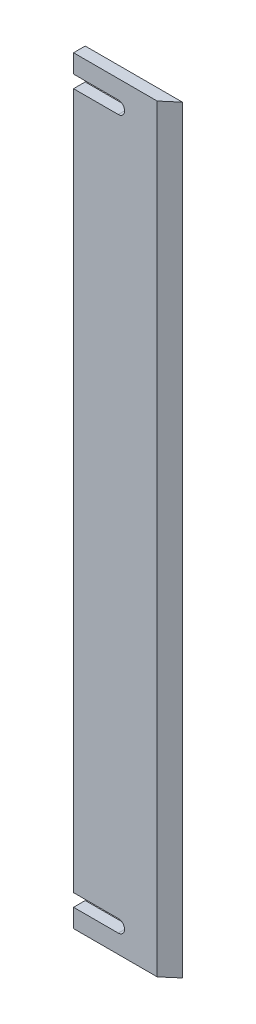
ISO-10303-21;
HEADER;
FILE_DESCRIPTION(('STEP AP214'),'2;1');
FILE_NAME('part.step','',(''),(''),'','','');
FILE_SCHEMA(('AUTOMOTIVE_DESIGN { 1 0 10303 214 1 1 1 1 }'));
ENDSEC;
DATA;
#1=APPLICATION_CONTEXT('core data for automotive mechanical design processes');
#2=APPLICATION_PROTOCOL_DEFINITION('international standard','automotive_design',2000,#1);
#3=PRODUCT_CONTEXT('',#1,'mechanical');
#4=PRODUCT('Part','Part','',(#3));
#5=PRODUCT_RELATED_PRODUCT_CATEGORY('part','',(#4));
#6=PRODUCT_DEFINITION_FORMATION('','',#4);
#7=PRODUCT_DEFINITION_CONTEXT('part definition',#1,'design');
#8=PRODUCT_DEFINITION('design','',#6,#7);
#9=PRODUCT_DEFINITION_SHAPE('','',#8);
#10=(LENGTH_UNIT() NAMED_UNIT(*) SI_UNIT(.MILLI.,.METRE.));
#11=(NAMED_UNIT(*) PLANE_ANGLE_UNIT() SI_UNIT($,.RADIAN.));
#12=(NAMED_UNIT(*) SI_UNIT($,.STERADIAN.) SOLID_ANGLE_UNIT());
#13=UNCERTAINTY_MEASURE_WITH_UNIT(LENGTH_MEASURE(1.E-05),#10,'distance_accuracy_value','');
#14=(GEOMETRIC_REPRESENTATION_CONTEXT(3) GLOBAL_UNCERTAINTY_ASSIGNED_CONTEXT((#13)) GLOBAL_UNIT_ASSIGNED_CONTEXT((#10,
#11,#12)) REPRESENTATION_CONTEXT('',''));
#15=CARTESIAN_POINT('',(0.,0.,0.));
#16=DIRECTION('',(0.,0.,1.));
#17=DIRECTION('',(1.,0.,0.));
#18=AXIS2_PLACEMENT_3D('',#15,#16,#17);
#19=CARTESIAN_POINT('',(-12.8506493506493,195.,-3.));
#20=DIRECTION('',(1.,0.,0.));
#21=DIRECTION('',(0.,0.,-1.));
#22=AXIS2_PLACEMENT_3D('',#19,#20,#21);
#23=PLANE('',#22);
#24=DIRECTION('',(0.,-1.,0.));
#25=VECTOR('',#24,1.);
#26=CARTESIAN_POINT('',(-12.8506493506493,195.,0.));
#27=LINE('',#26,#25);
#28=CARTESIAN_POINT('',(-12.8506493506494,4.75,0.));
#29=VERTEX_POINT('',#28);
#30=CARTESIAN_POINT('',(-12.8506493506493,0.,0.));
#31=VERTEX_POINT('',#30);
#32=EDGE_CURVE('E197',#29,#31,#27,.T.);
#33=ORIENTED_EDGE('',*,*,#32,.F.);
#34=DIRECTION('',(0.,0.,1.));
#35=VECTOR('',#34,1.);
#36=CARTESIAN_POINT('',(-12.8506493506494,4.75,-10.));
#37=LINE('',#36,#35);
#38=CARTESIAN_POINT('',(-12.8506493506494,4.75,-3.));
#39=VERTEX_POINT('',#38);
#40=EDGE_CURVE('E151',#39,#29,#37,.T.);
#41=ORIENTED_EDGE('',*,*,#40,.F.);
#42=DIRECTION('',(0.,-1.,0.));
#43=VECTOR('',#42,1.);
#44=CARTESIAN_POINT('',(-12.8506493506493,195.,-3.));
#45=LINE('',#44,#43);
#46=CARTESIAN_POINT('',(-12.8506493506493,0.,-3.));
#47=VERTEX_POINT('',#46);
#48=EDGE_CURVE('E178',#39,#47,#45,.T.);
#49=ORIENTED_EDGE('',*,*,#48,.T.);
#50=DIRECTION('',(0.,0.,1.));
#51=VECTOR('',#50,1.);
#52=CARTESIAN_POINT('',(-12.8506493506493,0.,-3.));
#53=LINE('',#52,#51);
#54=EDGE_CURVE('E150',#47,#31,#53,.T.);
#55=ORIENTED_EDGE('',*,*,#54,.T.);
#56=EDGE_LOOP('',(#33,#41,#49,#55));
#57=FACE_BOUND('',#56,.T.);
#58=ADVANCED_FACE('F34',(#57),#23,.F.);
#59=CARTESIAN_POINT('',(-12.8506493506493,195.,-3.));
#60=VERTEX_POINT('',#59);
#61=CARTESIAN_POINT('',(-12.8506493506494,190.25,-3.));
#62=VERTEX_POINT('',#61);
#63=EDGE_CURVE('E187',#60,#62,#45,.T.);
#64=ORIENTED_EDGE('',*,*,#63,.T.);
#65=DIRECTION('',(0.,0.,1.));
#66=VECTOR('',#65,1.);
#67=CARTESIAN_POINT('',(-12.8506493506494,190.25,-10.));
#68=LINE('',#67,#66);
#69=CARTESIAN_POINT('',(-12.8506493506494,190.25,0.));
#70=VERTEX_POINT('',#69);
#71=EDGE_CURVE('E139',#62,#70,#68,.T.);
#72=ORIENTED_EDGE('',*,*,#71,.T.);
#73=CARTESIAN_POINT('',(-12.8506493506493,195.,0.));
#74=VERTEX_POINT('',#73);
#75=EDGE_CURVE('E198',#74,#70,#27,.T.);
#76=ORIENTED_EDGE('',*,*,#75,.F.);
#77=DIRECTION('',(0.,0.,1.));
#78=VECTOR('',#77,1.);
#79=CARTESIAN_POINT('',(-12.8506493506493,195.,-3.));
#80=LINE('',#79,#78);
#81=EDGE_CURVE('E168',#60,#74,#80,.T.);
#82=ORIENTED_EDGE('',*,*,#81,.F.);
#83=EDGE_LOOP('',(#64,#72,#76,#82));
#84=FACE_BOUND('',#83,.T.);
#85=ADVANCED_FACE('F240',(#84),#23,.F.);
#86=CARTESIAN_POINT('',(-12.8506493506494,187.,-3.));
#87=VERTEX_POINT('',#86);
#88=CARTESIAN_POINT('',(-12.8506493506493,8.00000000000001,-3.));
#89=VERTEX_POINT('',#88);
#90=EDGE_CURVE('E191',#87,#89,#45,.T.);
#91=ORIENTED_EDGE('',*,*,#90,.T.);
#92=DIRECTION('',(0.,0.,1.));
#93=VECTOR('',#92,1.);
#94=CARTESIAN_POINT('',(-12.8506493506494,8.,-10.));
#95=LINE('',#94,#93);
#96=CARTESIAN_POINT('',(-12.8506493506494,8.,0.));
#97=VERTEX_POINT('',#96);
#98=EDGE_CURVE('E57',#89,#97,#95,.T.);
#99=ORIENTED_EDGE('',*,*,#98,.T.);
#100=CARTESIAN_POINT('',(-12.8506493506494,187.,0.));
#101=VERTEX_POINT('',#100);
#102=EDGE_CURVE('E145',#101,#97,#27,.T.);
#103=ORIENTED_EDGE('',*,*,#102,.F.);
#104=DIRECTION('',(0.,0.,1.));
#105=VECTOR('',#104,1.);
#106=CARTESIAN_POINT('',(-12.8506493506494,187.,-10.));
#107=LINE('',#106,#105);
#108=EDGE_CURVE('E161',#87,#101,#107,.T.);
#109=ORIENTED_EDGE('',*,*,#108,.F.);
#110=EDGE_LOOP('',(#91,#99,#103,#109));
#111=FACE_BOUND('',#110,.T.);
#112=ADVANCED_FACE('F36',(#111),#23,.F.);
#113=CARTESIAN_POINT('',(-12.8506493506493,195.,0.));
#114=DIRECTION('',(0.,0.,-1.));
#115=DIRECTION('',(-1.,0.,0.));
#116=AXIS2_PLACEMENT_3D('',#113,#114,#115);
#117=PLANE('',#116);
#118=CARTESIAN_POINT('',(-1.35064935064935,6.375,0.));
#119=DIRECTION('',(0.,0.,1.));
#120=DIRECTION('',(1.,0.,0.));
#121=AXIS2_PLACEMENT_3D('',#118,#119,#120);
#122=CIRCLE('',#121,1.625);
#123=CARTESIAN_POINT('',(-1.35064935064935,4.75,0.));
#124=VERTEX_POINT('',#123);
#125=CARTESIAN_POINT('',(-1.35064935064935,8.,0.));
#126=VERTEX_POINT('',#125);
#127=EDGE_CURVE('E132',#124,#126,#122,.T.);
#128=ORIENTED_EDGE('',*,*,#127,.F.);
#129=DIRECTION('',(1.,0.,0.));
#130=VECTOR('',#129,1.);
#131=CARTESIAN_POINT('',(-1.35064935064935,4.75,0.));
#132=LINE('',#131,#130);
#133=EDGE_CURVE('E129',#29,#124,#132,.T.);
#134=ORIENTED_EDGE('',*,*,#133,.F.);
#135=ORIENTED_EDGE('',*,*,#32,.T.);
#136=DIRECTION('',(1.,0.,0.));
#137=VECTOR('',#136,1.);
#138=CARTESIAN_POINT('',(-12.8506493506493,0.,0.));
#139=LINE('',#138,#137);
#140=CARTESIAN_POINT('',(8.64935064935065,0.,0.));
#141=VERTEX_POINT('',#140);
#142=EDGE_CURVE('E181',#31,#141,#139,.T.);
#143=ORIENTED_EDGE('',*,*,#142,.T.);
#144=DIRECTION('',(0.,-1.,0.));
#145=VECTOR('',#144,1.);
#146=CARTESIAN_POINT('',(8.64935064935065,195.,0.));
#147=LINE('',#146,#145);
#148=CARTESIAN_POINT('',(8.64935064935065,195.,0.));
#149=VERTEX_POINT('',#148);
#150=EDGE_CURVE('E194',#149,#141,#147,.T.);
#151=ORIENTED_EDGE('',*,*,#150,.F.);
#152=DIRECTION('',(1.,0.,0.));
#153=VECTOR('',#152,1.);
#154=CARTESIAN_POINT('',(-12.8506493506493,195.,0.));
#155=LINE('',#154,#153);
#156=EDGE_CURVE('E171',#74,#149,#155,.T.);
#157=ORIENTED_EDGE('',*,*,#156,.F.);
#158=ORIENTED_EDGE('',*,*,#75,.T.);
#159=DIRECTION('',(-1.,0.,0.));
#160=VECTOR('',#159,1.);
#161=CARTESIAN_POINT('',(-1.35064935064935,190.25,0.));
#162=LINE('',#161,#160);
#163=CARTESIAN_POINT('',(-1.35064935064935,190.25,0.));
#164=VERTEX_POINT('',#163);
#165=EDGE_CURVE('E159',#164,#70,#162,.T.);
#166=ORIENTED_EDGE('',*,*,#165,.F.);
#167=CARTESIAN_POINT('',(-1.35064935064935,188.625,0.));
#168=DIRECTION('',(0.,0.,1.));
#169=DIRECTION('',(-1.,0.,0.));
#170=AXIS2_PLACEMENT_3D('',#167,#168,#169);
#171=CIRCLE('',#170,1.625);
#172=CARTESIAN_POINT('',(-1.35064935064935,187.,0.));
#173=VERTEX_POINT('',#172);
#174=EDGE_CURVE('E156',#173,#164,#171,.T.);
#175=ORIENTED_EDGE('',*,*,#174,.F.);
#176=DIRECTION('',(1.,0.,0.));
#177=VECTOR('',#176,1.);
#178=CARTESIAN_POINT('',(-12.8506493506494,187.,0.));
#179=LINE('',#178,#177);
#180=EDGE_CURVE('E154',#101,#173,#179,.T.);
#181=ORIENTED_EDGE('',*,*,#180,.F.);
#182=ORIENTED_EDGE('',*,*,#102,.T.);
#183=DIRECTION('',(-1.,0.,0.));
#184=VECTOR('',#183,1.);
#185=CARTESIAN_POINT('',(-12.8506493506494,8.,0.));
#186=LINE('',#185,#184);
#187=EDGE_CURVE('E125',#126,#97,#186,.T.);
#188=ORIENTED_EDGE('',*,*,#187,.F.);
#189=EDGE_LOOP('',(#128,#134,#135,#143,#151,#157,#158,#166,#175,#181,#182,#188));
#190=FACE_BOUND('',#189,.T.);
#191=ADVANCED_FACE('F142',(#190),#117,.F.);
#192=CARTESIAN_POINT('',(8.64935064935065,195.,0.));
#193=DIRECTION('',(-0.650791373455968,0.,-0.759256602365296));
#194=DIRECTION('',(-0.759256602365297,0.,0.650791373455969));
#195=AXIS2_PLACEMENT_3D('',#192,#193,#194);
#196=PLANE('',#195);
#197=DIRECTION('',(0.759256602365297,0.,-0.650791373455969));
#198=VECTOR('',#197,1.);
#199=CARTESIAN_POINT('',(8.64935064935065,0.,0.));
#200=LINE('',#199,#198);
#201=CARTESIAN_POINT('',(12.1493506493507,0.,-3.));
#202=VERTEX_POINT('',#201);
#203=EDGE_CURVE('E183',#141,#202,#200,.T.);
#204=ORIENTED_EDGE('',*,*,#203,.T.);
#205=DIRECTION('',(0.,-1.,0.));
#206=VECTOR('',#205,1.);
#207=CARTESIAN_POINT('',(12.1493506493507,195.,-3.));
#208=LINE('',#207,#206);
#209=CARTESIAN_POINT('',(12.1493506493507,195.,-3.));
#210=VERTEX_POINT('',#209);
#211=EDGE_CURVE('E190',#210,#202,#208,.T.);
#212=ORIENTED_EDGE('',*,*,#211,.F.);
#213=DIRECTION('',(0.759256602365297,0.,-0.650791373455969));
#214=VECTOR('',#213,1.);
#215=CARTESIAN_POINT('',(8.64935064935065,195.,0.));
#216=LINE('',#215,#214);
#217=EDGE_CURVE('E174',#149,#210,#216,.T.);
#218=ORIENTED_EDGE('',*,*,#217,.F.);
#219=ORIENTED_EDGE('',*,*,#150,.T.);
#220=EDGE_LOOP('',(#204,#212,#218,#219));
#221=FACE_BOUND('',#220,.T.);
#222=ADVANCED_FACE('F229',(#221),#196,.F.);
#223=CARTESIAN_POINT('',(12.1493506493507,195.,-3.));
#224=DIRECTION('',(0.,0.,1.));
#225=DIRECTION('',(1.,0.,0.));
#226=AXIS2_PLACEMENT_3D('',#223,#224,#225);
#227=PLANE('',#226);
#228=ORIENTED_EDGE('',*,*,#48,.F.);
#229=DIRECTION('',(1.,0.,0.));
#230=VECTOR('',#229,1.);
#231=CARTESIAN_POINT('',(12.1493506493507,4.75,-3.));
#232=LINE('',#231,#230);
#233=CARTESIAN_POINT('',(-1.35064935064935,4.75,-3.));
#234=VERTEX_POINT('',#233);
#235=EDGE_CURVE('E11',#39,#234,#232,.T.);
#236=ORIENTED_EDGE('',*,*,#235,.T.);
#237=CARTESIAN_POINT('',(-1.35064935064935,6.375,-3.));
#238=DIRECTION('',(0.,0.,1.));
#239=DIRECTION('',(1.,0.,0.));
#240=AXIS2_PLACEMENT_3D('',#237,#238,#239);
#241=CIRCLE('',#240,1.625);
#242=CARTESIAN_POINT('',(-1.35064935064935,8.,-3.));
#243=VERTEX_POINT('',#242);
#244=EDGE_CURVE('E42',#234,#243,#241,.T.);
#245=ORIENTED_EDGE('',*,*,#244,.T.);
#246=DIRECTION('',(-1.,0.,0.));
#247=VECTOR('',#246,1.);
#248=CARTESIAN_POINT('',(12.1493506493507,8.00000000000001,-3.));
#249=LINE('',#248,#247);
#250=EDGE_CURVE('E126',#243,#89,#249,.T.);
#251=ORIENTED_EDGE('',*,*,#250,.T.);
#252=ORIENTED_EDGE('',*,*,#90,.F.);
#253=DIRECTION('',(1.,0.,0.));
#254=VECTOR('',#253,1.);
#255=CARTESIAN_POINT('',(12.1493506493507,187.,-3.));
#256=LINE('',#255,#254);
#257=CARTESIAN_POINT('',(-1.35064935064935,187.,-3.));
#258=VERTEX_POINT('',#257);
#259=EDGE_CURVE('E201',#87,#258,#256,.T.);
#260=ORIENTED_EDGE('',*,*,#259,.T.);
#261=CARTESIAN_POINT('',(-1.35064935064935,188.625,-3.));
#262=DIRECTION('',(0.,0.,1.));
#263=DIRECTION('',(1.,0.,0.));
#264=AXIS2_PLACEMENT_3D('',#261,#262,#263);
#265=CIRCLE('',#264,1.625);
#266=CARTESIAN_POINT('',(-1.35064935064935,190.25,-3.));
#267=VERTEX_POINT('',#266);
#268=EDGE_CURVE('E204',#258,#267,#265,.T.);
#269=ORIENTED_EDGE('',*,*,#268,.T.);
#270=DIRECTION('',(-1.,0.,0.));
#271=VECTOR('',#270,1.);
#272=CARTESIAN_POINT('',(12.1493506493507,190.25,-3.));
#273=LINE('',#272,#271);
#274=EDGE_CURVE('E207',#267,#62,#273,.T.);
#275=ORIENTED_EDGE('',*,*,#274,.T.);
#276=ORIENTED_EDGE('',*,*,#63,.F.);
#277=DIRECTION('',(-1.,0.,0.));
#278=VECTOR('',#277,1.);
#279=CARTESIAN_POINT('',(12.1493506493507,195.,-3.));
#280=LINE('',#279,#278);
#281=EDGE_CURVE('E176',#210,#60,#280,.T.);
#282=ORIENTED_EDGE('',*,*,#281,.F.);
#283=ORIENTED_EDGE('',*,*,#211,.T.);
#284=DIRECTION('',(-1.,0.,0.));
#285=VECTOR('',#284,1.);
#286=CARTESIAN_POINT('',(12.1493506493507,0.,-3.));
#287=LINE('',#286,#285);
#288=EDGE_CURVE('E172',#202,#47,#287,.T.);
#289=ORIENTED_EDGE('',*,*,#288,.T.);
#290=EDGE_LOOP('',(#228,#236,#245,#251,#252,#260,#269,#275,#276,#282,#283,#289));
#291=FACE_BOUND('',#290,.T.);
#292=ADVANCED_FACE('F212',(#291),#227,.F.);
#293=CARTESIAN_POINT('',(0.,195.,0.));
#294=DIRECTION('',(0.,1.,0.));
#295=DIRECTION('',(0.,0.,1.));
#296=AXIS2_PLACEMENT_3D('',#293,#294,#295);
#297=PLANE('',#296);
#298=ORIENTED_EDGE('',*,*,#81,.T.);
#299=ORIENTED_EDGE('',*,*,#156,.T.);
#300=ORIENTED_EDGE('',*,*,#217,.T.);
#301=ORIENTED_EDGE('',*,*,#281,.T.);
#302=EDGE_LOOP('',(#298,#299,#300,#301));
#303=FACE_BOUND('',#302,.T.);
#304=ADVANCED_FACE('F233',(#303),#297,.T.);
#305=CARTESIAN_POINT('',(0.,0.,0.));
#306=DIRECTION('',(0.,1.,0.));
#307=DIRECTION('',(0.,0.,1.));
#308=AXIS2_PLACEMENT_3D('',#305,#306,#307);
#309=PLANE('',#308);
#310=ORIENTED_EDGE('',*,*,#54,.F.);
#311=ORIENTED_EDGE('',*,*,#288,.F.);
#312=ORIENTED_EDGE('',*,*,#203,.F.);
#313=ORIENTED_EDGE('',*,*,#142,.F.);
#314=EDGE_LOOP('',(#310,#311,#312,#313));
#315=FACE_BOUND('',#314,.T.);
#316=ADVANCED_FACE('F224',(#315),#309,.F.);
#317=CARTESIAN_POINT('',(-1.35064935064935,190.25,-10.));
#318=DIRECTION('',(0.,1.,0.));
#319=DIRECTION('',(0.,0.,1.));
#320=AXIS2_PLACEMENT_3D('',#317,#318,#319);
#321=PLANE('',#320);
#322=DIRECTION('',(0.,0.,1.));
#323=VECTOR('',#322,1.);
#324=CARTESIAN_POINT('',(-1.35064935064935,190.25,-10.));
#325=LINE('',#324,#323);
#326=EDGE_CURVE('E164',#267,#164,#325,.T.);
#327=ORIENTED_EDGE('',*,*,#326,.T.);
#328=ORIENTED_EDGE('',*,*,#165,.T.);
#329=ORIENTED_EDGE('',*,*,#71,.F.);
#330=ORIENTED_EDGE('',*,*,#274,.F.);
#331=EDGE_LOOP('',(#327,#328,#329,#330));
#332=FACE_BOUND('',#331,.T.);
#333=ADVANCED_FACE('F242',(#332),#321,.F.);
#334=CARTESIAN_POINT('',(-1.35064935064935,188.625,-10.));
#335=DIRECTION('',(0.,0.,1.));
#336=DIRECTION('',(1.,0.,0.));
#337=AXIS2_PLACEMENT_3D('',#334,#335,#336);
#338=CYLINDRICAL_SURFACE('',#337,1.625);
#339=DIRECTION('',(0.,0.,1.));
#340=VECTOR('',#339,1.);
#341=CARTESIAN_POINT('',(-1.35064935064935,187.,-10.));
#342=LINE('',#341,#340);
#343=EDGE_CURVE('E49',#258,#173,#342,.T.);
#344=ORIENTED_EDGE('',*,*,#343,.T.);
#345=ORIENTED_EDGE('',*,*,#174,.T.);
#346=ORIENTED_EDGE('',*,*,#326,.F.);
#347=ORIENTED_EDGE('',*,*,#268,.F.);
#348=EDGE_LOOP('',(#344,#345,#346,#347));
#349=FACE_BOUND('',#348,.T.);
#350=ADVANCED_FACE('F245',(#349),#338,.F.);
#351=CARTESIAN_POINT('',(-12.8506493506494,187.,-10.));
#352=DIRECTION('',(0.,-1.,0.));
#353=DIRECTION('',(0.,0.,-1.));
#354=AXIS2_PLACEMENT_3D('',#351,#352,#353);
#355=PLANE('',#354);
#356=ORIENTED_EDGE('',*,*,#108,.T.);
#357=ORIENTED_EDGE('',*,*,#180,.T.);
#358=ORIENTED_EDGE('',*,*,#343,.F.);
#359=ORIENTED_EDGE('',*,*,#259,.F.);
#360=EDGE_LOOP('',(#356,#357,#358,#359));
#361=FACE_BOUND('',#360,.T.);
#362=ADVANCED_FACE('F248',(#361),#355,.F.);
#363=CARTESIAN_POINT('',(-1.35064935064935,6.375,-10.));
#364=DIRECTION('',(0.,0.,1.));
#365=DIRECTION('',(1.,0.,0.));
#366=AXIS2_PLACEMENT_3D('',#363,#364,#365);
#367=CYLINDRICAL_SURFACE('',#366,1.625);
#368=DIRECTION('',(0.,0.,1.));
#369=VECTOR('',#368,1.);
#370=CARTESIAN_POINT('',(-1.35064935064935,4.75,-10.));
#371=LINE('',#370,#369);
#372=EDGE_CURVE('E135',#234,#124,#371,.T.);
#373=ORIENTED_EDGE('',*,*,#372,.T.);
#374=ORIENTED_EDGE('',*,*,#127,.T.);
#375=DIRECTION('',(0.,0.,1.));
#376=VECTOR('',#375,1.);
#377=CARTESIAN_POINT('',(-1.35064935064935,8.,-10.));
#378=LINE('',#377,#376);
#379=EDGE_CURVE('E121',#243,#126,#378,.T.);
#380=ORIENTED_EDGE('',*,*,#379,.F.);
#381=ORIENTED_EDGE('',*,*,#244,.F.);
#382=EDGE_LOOP('',(#373,#374,#380,#381));
#383=FACE_BOUND('',#382,.T.);
#384=ADVANCED_FACE('F133',(#383),#367,.F.);
#385=CARTESIAN_POINT('',(-1.35064935064935,4.75,-10.));
#386=DIRECTION('',(0.,-1.,0.));
#387=DIRECTION('',(0.,0.,-1.));
#388=AXIS2_PLACEMENT_3D('',#385,#386,#387);
#389=PLANE('',#388);
#390=ORIENTED_EDGE('',*,*,#40,.T.);
#391=ORIENTED_EDGE('',*,*,#133,.T.);
#392=ORIENTED_EDGE('',*,*,#372,.F.);
#393=ORIENTED_EDGE('',*,*,#235,.F.);
#394=EDGE_LOOP('',(#390,#391,#392,#393));
#395=FACE_BOUND('',#394,.T.);
#396=ADVANCED_FACE('F216',(#395),#389,.F.);
#397=CARTESIAN_POINT('',(-12.8506493506494,8.,-10.));
#398=DIRECTION('',(0.,1.,0.));
#399=DIRECTION('',(0.,0.,1.));
#400=AXIS2_PLACEMENT_3D('',#397,#398,#399);
#401=PLANE('',#400);
#402=ORIENTED_EDGE('',*,*,#379,.T.);
#403=ORIENTED_EDGE('',*,*,#187,.T.);
#404=ORIENTED_EDGE('',*,*,#98,.F.);
#405=ORIENTED_EDGE('',*,*,#250,.F.);
#406=EDGE_LOOP('',(#402,#403,#404,#405));
#407=FACE_BOUND('',#406,.T.);
#408=ADVANCED_FACE('F123',(#407),#401,.F.);
#409=CLOSED_SHELL('',(#58,#85,#112,#191,#222,#292,#304,#316,#333,#350,#362,#384,#396,#408));
#410=MANIFOLD_SOLID_BREP('B2',#409);
#411=ADVANCED_BREP_SHAPE_REPRESENTATION('',(#18,#410),#14);
#412=SHAPE_DEFINITION_REPRESENTATION(#9,#411);
ENDSEC;
END-ISO-10303-21;
